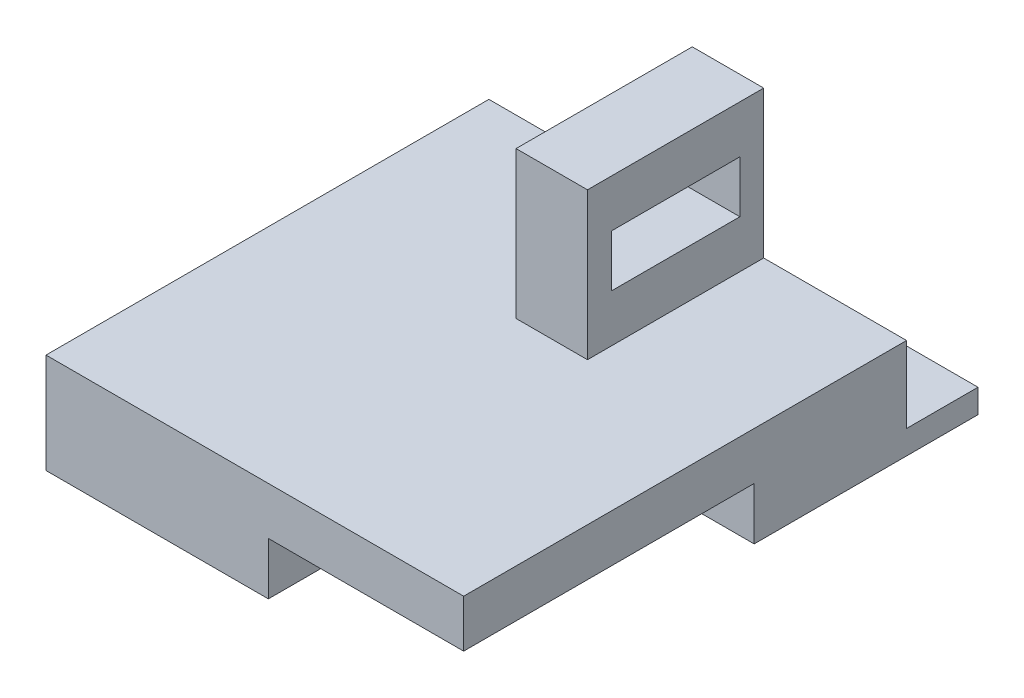
ISO-10303-21;
HEADER;
FILE_DESCRIPTION(('STEP AP214'),'2;1');
FILE_NAME('part.step','',(''),(''),'','','');
FILE_SCHEMA(('AUTOMOTIVE_DESIGN { 1 0 10303 214 1 1 1 1 }'));
ENDSEC;
DATA;
#1=APPLICATION_CONTEXT('core data for automotive mechanical design processes');
#2=APPLICATION_PROTOCOL_DEFINITION('international standard','automotive_design',2000,#1);
#3=PRODUCT_CONTEXT('',#1,'mechanical');
#4=PRODUCT('Part','Part','',(#3));
#5=PRODUCT_RELATED_PRODUCT_CATEGORY('part','',(#4));
#6=PRODUCT_DEFINITION_FORMATION('','',#4);
#7=PRODUCT_DEFINITION_CONTEXT('part definition',#1,'design');
#8=PRODUCT_DEFINITION('design','',#6,#7);
#9=PRODUCT_DEFINITION_SHAPE('','',#8);
#10=(LENGTH_UNIT() NAMED_UNIT(*) SI_UNIT(.MILLI.,.METRE.));
#11=(NAMED_UNIT(*) PLANE_ANGLE_UNIT() SI_UNIT($,.RADIAN.));
#12=(NAMED_UNIT(*) SI_UNIT($,.STERADIAN.) SOLID_ANGLE_UNIT());
#13=UNCERTAINTY_MEASURE_WITH_UNIT(LENGTH_MEASURE(1.E-05),#10,'distance_accuracy_value','');
#14=(GEOMETRIC_REPRESENTATION_CONTEXT(3) GLOBAL_UNCERTAINTY_ASSIGNED_CONTEXT((#13)) GLOBAL_UNIT_ASSIGNED_CONTEXT((#10,
#11,#12)) REPRESENTATION_CONTEXT('',''));
#15=CARTESIAN_POINT('',(0.,0.,0.));
#16=DIRECTION('',(0.,0.,1.));
#17=DIRECTION('',(1.,0.,0.));
#18=AXIS2_PLACEMENT_3D('',#15,#16,#17);
#19=CARTESIAN_POINT('',(0.,21.,0.));
#20=DIRECTION('',(0.,-1.,0.));
#21=DIRECTION('',(0.,0.,-1.));
#22=AXIS2_PLACEMENT_3D('',#19,#20,#21);
#23=PLANE('',#22);
#24=DIRECTION('',(0.,0.,-1.));
#25=VECTOR('',#24,1.);
#26=CARTESIAN_POINT('',(57.7,21.,-93.));
#27=LINE('',#26,#25);
#28=CARTESIAN_POINT('',(57.7,21.,-56.));
#29=VERTEX_POINT('',#28);
#30=CARTESIAN_POINT('',(57.7,21.,-93.));
#31=VERTEX_POINT('',#30);
#32=EDGE_CURVE('E180',#29,#31,#27,.T.);
#33=ORIENTED_EDGE('',*,*,#32,.F.);
#34=DIRECTION('',(1.,0.,0.));
#35=VECTOR('',#34,1.);
#36=CARTESIAN_POINT('',(57.7,21.,-56.));
#37=LINE('',#36,#35);
#38=CARTESIAN_POINT('',(42.7,21.,-56.));
#39=VERTEX_POINT('',#38);
#40=EDGE_CURVE('E187',#39,#29,#37,.T.);
#41=ORIENTED_EDGE('',*,*,#40,.F.);
#42=DIRECTION('',(0.,0.,1.));
#43=VECTOR('',#42,1.);
#44=CARTESIAN_POINT('',(42.7,21.,-93.));
#45=LINE('',#44,#43);
#46=CARTESIAN_POINT('',(42.7,21.,-93.));
#47=VERTEX_POINT('',#46);
#48=EDGE_CURVE('E196',#47,#39,#45,.T.);
#49=ORIENTED_EDGE('',*,*,#48,.F.);
#50=DIRECTION('',(1.,0.,0.));
#51=VECTOR('',#50,1.);
#52=CARTESIAN_POINT('',(0.,21.,-93.));
#53=LINE('',#52,#51);
#54=CARTESIAN_POINT('',(0.,21.,-93.));
#55=VERTEX_POINT('',#54);
#56=EDGE_CURVE('E217',#55,#47,#53,.T.);
#57=ORIENTED_EDGE('',*,*,#56,.F.);
#58=DIRECTION('',(0.,0.,1.));
#59=VECTOR('',#58,1.);
#60=CARTESIAN_POINT('',(0.,21.,0.));
#61=LINE('',#60,#59);
#62=CARTESIAN_POINT('',(0.,21.,0.));
#63=VERTEX_POINT('',#62);
#64=EDGE_CURVE('E255',#55,#63,#61,.T.);
#65=ORIENTED_EDGE('',*,*,#64,.T.);
#66=DIRECTION('',(1.,0.,0.));
#67=VECTOR('',#66,1.);
#68=CARTESIAN_POINT('',(0.,21.,0.));
#69=LINE('',#68,#67);
#70=CARTESIAN_POINT('',(87.7,21.,0.));
#71=VERTEX_POINT('',#70);
#72=EDGE_CURVE('E257',#63,#71,#69,.T.);
#73=ORIENTED_EDGE('',*,*,#72,.T.);
#74=DIRECTION('',(0.,0.,-1.));
#75=VECTOR('',#74,1.);
#76=CARTESIAN_POINT('',(87.7,21.,0.));
#77=LINE('',#76,#75);
#78=CARTESIAN_POINT('',(87.7,21.,-93.));
#79=VERTEX_POINT('',#78);
#80=EDGE_CURVE('E260',#71,#79,#77,.T.);
#81=ORIENTED_EDGE('',*,*,#80,.T.);
#82=EDGE_CURVE('E212',#31,#79,#53,.T.);
#83=ORIENTED_EDGE('',*,*,#82,.F.);
#84=EDGE_LOOP('',(#33,#41,#49,#57,#65,#73,#81,#83));
#85=FACE_BOUND('',#84,.T.);
#86=ADVANCED_FACE('F35',(#85),#23,.F.);
#87=CARTESIAN_POINT('',(0.,21.,-108.));
#88=DIRECTION('',(0.,0.,1.));
#89=DIRECTION('',(1.,0.,0.));
#90=AXIS2_PLACEMENT_3D('',#87,#88,#89);
#91=PLANE('',#90);
#92=DIRECTION('',(-1.,0.,0.));
#93=VECTOR('',#92,1.);
#94=CARTESIAN_POINT('',(0.,5.,-108.));
#95=LINE('',#94,#93);
#96=CARTESIAN_POINT('',(87.7,5.,-108.));
#97=VERTEX_POINT('',#96);
#98=CARTESIAN_POINT('',(0.,5.,-108.));
#99=VERTEX_POINT('',#98);
#100=EDGE_CURVE('E222',#97,#99,#95,.T.);
#101=ORIENTED_EDGE('',*,*,#100,.F.);
#102=DIRECTION('',(0.,-1.,0.));
#103=VECTOR('',#102,1.);
#104=CARTESIAN_POINT('',(87.7,21.,-108.));
#105=LINE('',#104,#103);
#106=CARTESIAN_POINT('',(87.7,0.,-108.));
#107=VERTEX_POINT('',#106);
#108=EDGE_CURVE('E275',#97,#107,#105,.T.);
#109=ORIENTED_EDGE('',*,*,#108,.T.);
#110=DIRECTION('',(-1.,0.,0.));
#111=VECTOR('',#110,1.);
#112=CARTESIAN_POINT('',(0.,0.,-108.));
#113=LINE('',#112,#111);
#114=CARTESIAN_POINT('',(0.,0.,-108.));
#115=VERTEX_POINT('',#114);
#116=EDGE_CURVE('E258',#107,#115,#113,.T.);
#117=ORIENTED_EDGE('',*,*,#116,.T.);
#118=DIRECTION('',(0.,-1.,0.));
#119=VECTOR('',#118,1.);
#120=CARTESIAN_POINT('',(0.,21.,-108.));
#121=LINE('',#120,#119);
#122=EDGE_CURVE('E263',#99,#115,#121,.T.);
#123=ORIENTED_EDGE('',*,*,#122,.F.);
#124=EDGE_LOOP('',(#101,#109,#117,#123));
#125=FACE_BOUND('',#124,.T.);
#126=ADVANCED_FACE('F306',(#125),#91,.F.);
#127=CARTESIAN_POINT('',(0.,21.,0.));
#128=DIRECTION('',(1.,0.,0.));
#129=DIRECTION('',(0.,0.,-1.));
#130=AXIS2_PLACEMENT_3D('',#127,#128,#129);
#131=PLANE('',#130);
#132=ORIENTED_EDGE('',*,*,#64,.F.);
#133=DIRECTION('',(0.,1.,0.));
#134=VECTOR('',#133,1.);
#135=CARTESIAN_POINT('',(0.,5.,-93.));
#136=LINE('',#135,#134);
#137=CARTESIAN_POINT('',(0.,5.,-93.));
#138=VERTEX_POINT('',#137);
#139=EDGE_CURVE('E224',#138,#55,#136,.T.);
#140=ORIENTED_EDGE('',*,*,#139,.F.);
#141=DIRECTION('',(0.,0.,1.));
#142=VECTOR('',#141,1.);
#143=CARTESIAN_POINT('',(0.,5.,-108.));
#144=LINE('',#143,#142);
#145=EDGE_CURVE('E213',#99,#138,#144,.T.);
#146=ORIENTED_EDGE('',*,*,#145,.F.);
#147=ORIENTED_EDGE('',*,*,#122,.T.);
#148=DIRECTION('',(0.,0.,1.));
#149=VECTOR('',#148,1.);
#150=CARTESIAN_POINT('',(0.,0.,0.));
#151=LINE('',#150,#149);
#152=CARTESIAN_POINT('',(0.,0.,0.));
#153=VERTEX_POINT('',#152);
#154=EDGE_CURVE('E251',#115,#153,#151,.T.);
#155=ORIENTED_EDGE('',*,*,#154,.T.);
#156=DIRECTION('',(0.,-1.,0.));
#157=VECTOR('',#156,1.);
#158=CARTESIAN_POINT('',(0.,21.,0.));
#159=LINE('',#158,#157);
#160=EDGE_CURVE('E280',#63,#153,#159,.T.);
#161=ORIENTED_EDGE('',*,*,#160,.F.);
#162=EDGE_LOOP('',(#132,#140,#146,#147,#155,#161));
#163=FACE_BOUND('',#162,.T.);
#164=ADVANCED_FACE('F37',(#163),#131,.F.);
#165=CARTESIAN_POINT('',(0.,21.,0.));
#166=DIRECTION('',(0.,0.,-1.));
#167=DIRECTION('',(-1.,0.,0.));
#168=AXIS2_PLACEMENT_3D('',#165,#166,#167);
#169=PLANE('',#168);
#170=DIRECTION('',(1.,0.,0.));
#171=VECTOR('',#170,1.);
#172=CARTESIAN_POINT('',(0.,0.,0.));
#173=LINE('',#172,#171);
#174=CARTESIAN_POINT('',(46.6919549273825,0.,0.));
#175=VERTEX_POINT('',#174);
#176=EDGE_CURVE('E266',#153,#175,#173,.T.);
#177=ORIENTED_EDGE('',*,*,#176,.T.);
#178=DIRECTION('',(0.,-1.,0.));
#179=VECTOR('',#178,1.);
#180=CARTESIAN_POINT('',(46.6919549273825,11.,0.));
#181=LINE('',#180,#179);
#182=CARTESIAN_POINT('',(46.6919549273825,11.,0.));
#183=VERTEX_POINT('',#182);
#184=EDGE_CURVE('E244',#183,#175,#181,.T.);
#185=ORIENTED_EDGE('',*,*,#184,.F.);
#186=DIRECTION('',(-1.,0.,0.));
#187=VECTOR('',#186,1.);
#188=CARTESIAN_POINT('',(87.7,11.,0.));
#189=LINE('',#188,#187);
#190=CARTESIAN_POINT('',(87.7,11.,0.));
#191=VERTEX_POINT('',#190);
#192=EDGE_CURVE('E234',#191,#183,#189,.T.);
#193=ORIENTED_EDGE('',*,*,#192,.F.);
#194=DIRECTION('',(0.,-1.,0.));
#195=VECTOR('',#194,1.);
#196=CARTESIAN_POINT('',(87.7,21.,0.));
#197=LINE('',#196,#195);
#198=EDGE_CURVE('E277',#71,#191,#197,.T.);
#199=ORIENTED_EDGE('',*,*,#198,.F.);
#200=ORIENTED_EDGE('',*,*,#72,.F.);
#201=ORIENTED_EDGE('',*,*,#160,.T.);
#202=EDGE_LOOP('',(#177,#185,#193,#199,#200,#201));
#203=FACE_BOUND('',#202,.T.);
#204=ADVANCED_FACE('F327',(#203),#169,.F.);
#205=CARTESIAN_POINT('',(87.7,21.,0.));
#206=DIRECTION('',(-1.,0.,0.));
#207=DIRECTION('',(0.,0.,1.));
#208=AXIS2_PLACEMENT_3D('',#205,#206,#207);
#209=PLANE('',#208);
#210=DIRECTION('',(0.,0.,-1.));
#211=VECTOR('',#210,1.);
#212=CARTESIAN_POINT('',(87.7,5.,-108.));
#213=LINE('',#212,#211);
#214=CARTESIAN_POINT('',(87.7,5.,-93.));
#215=VERTEX_POINT('',#214);
#216=EDGE_CURVE('E220',#215,#97,#213,.T.);
#217=ORIENTED_EDGE('',*,*,#216,.F.);
#218=DIRECTION('',(0.,1.,0.));
#219=VECTOR('',#218,1.);
#220=CARTESIAN_POINT('',(87.7,5.,-93.));
#221=LINE('',#220,#219);
#222=EDGE_CURVE('E227',#215,#79,#221,.T.);
#223=ORIENTED_EDGE('',*,*,#222,.T.);
#224=ORIENTED_EDGE('',*,*,#80,.F.);
#225=ORIENTED_EDGE('',*,*,#198,.T.);
#226=DIRECTION('',(0.,0.,1.));
#227=VECTOR('',#226,1.);
#228=CARTESIAN_POINT('',(87.7,11.,0.));
#229=LINE('',#228,#227);
#230=CARTESIAN_POINT('',(87.7,11.,-61.));
#231=VERTEX_POINT('',#230);
#232=EDGE_CURVE('E232',#231,#191,#229,.T.);
#233=ORIENTED_EDGE('',*,*,#232,.F.);
#234=DIRECTION('',(0.,-1.,0.));
#235=VECTOR('',#234,1.);
#236=CARTESIAN_POINT('',(87.7,11.,-61.));
#237=LINE('',#236,#235);
#238=CARTESIAN_POINT('',(87.7,0.,-61.));
#239=VERTEX_POINT('',#238);
#240=EDGE_CURVE('E248',#231,#239,#237,.T.);
#241=ORIENTED_EDGE('',*,*,#240,.T.);
#242=DIRECTION('',(0.,0.,-1.));
#243=VECTOR('',#242,1.);
#244=CARTESIAN_POINT('',(87.7,0.,0.));
#245=LINE('',#244,#243);
#246=EDGE_CURVE('E269',#239,#107,#245,.T.);
#247=ORIENTED_EDGE('',*,*,#246,.T.);
#248=ORIENTED_EDGE('',*,*,#108,.F.);
#249=EDGE_LOOP('',(#217,#223,#224,#225,#233,#241,#247,#248));
#250=FACE_BOUND('',#249,.T.);
#251=ADVANCED_FACE('F323',(#250),#209,.F.);
#252=CARTESIAN_POINT('',(0.,0.,0.));
#253=DIRECTION('',(0.,-1.,0.));
#254=DIRECTION('',(0.,0.,-1.));
#255=AXIS2_PLACEMENT_3D('',#252,#253,#254);
#256=PLANE('',#255);
#257=DIRECTION('',(1.,0.,0.));
#258=VECTOR('',#257,1.);
#259=CARTESIAN_POINT('',(87.7,0.,-61.));
#260=LINE('',#259,#258);
#261=CARTESIAN_POINT('',(46.6919549273825,0.,-61.));
#262=VERTEX_POINT('',#261);
#263=EDGE_CURVE('E235',#262,#239,#260,.T.);
#264=ORIENTED_EDGE('',*,*,#263,.F.);
#265=DIRECTION('',(0.,0.,-1.));
#266=VECTOR('',#265,1.);
#267=CARTESIAN_POINT('',(46.6919549273825,0.,0.));
#268=LINE('',#267,#266);
#269=EDGE_CURVE('E230',#175,#262,#268,.T.);
#270=ORIENTED_EDGE('',*,*,#269,.F.);
#271=ORIENTED_EDGE('',*,*,#176,.F.);
#272=ORIENTED_EDGE('',*,*,#154,.F.);
#273=ORIENTED_EDGE('',*,*,#116,.F.);
#274=ORIENTED_EDGE('',*,*,#246,.F.);
#275=EDGE_LOOP('',(#264,#270,#271,#272,#273,#274));
#276=FACE_BOUND('',#275,.T.);
#277=ADVANCED_FACE('F320',(#276),#256,.T.);
#278=CARTESIAN_POINT('',(87.7,11.,-61.));
#279=DIRECTION('',(0.,0.,-1.));
#280=DIRECTION('',(-1.,0.,0.));
#281=AXIS2_PLACEMENT_3D('',#278,#279,#280);
#282=PLANE('',#281);
#283=ORIENTED_EDGE('',*,*,#263,.T.);
#284=ORIENTED_EDGE('',*,*,#240,.F.);
#285=DIRECTION('',(1.,0.,0.));
#286=VECTOR('',#285,1.);
#287=CARTESIAN_POINT('',(87.7,11.,-61.));
#288=LINE('',#287,#286);
#289=CARTESIAN_POINT('',(46.6919549273825,11.,-61.));
#290=VERTEX_POINT('',#289);
#291=EDGE_CURVE('E241',#290,#231,#288,.T.);
#292=ORIENTED_EDGE('',*,*,#291,.F.);
#293=DIRECTION('',(0.,-1.,0.));
#294=VECTOR('',#293,1.);
#295=CARTESIAN_POINT('',(46.6919549273825,11.,-61.));
#296=LINE('',#295,#294);
#297=EDGE_CURVE('E252',#290,#262,#296,.T.);
#298=ORIENTED_EDGE('',*,*,#297,.T.);
#299=EDGE_LOOP('',(#283,#284,#292,#298));
#300=FACE_BOUND('',#299,.T.);
#301=ADVANCED_FACE('F322',(#300),#282,.F.);
#302=CARTESIAN_POINT('',(46.6919549273825,11.,0.));
#303=DIRECTION('',(-1.,0.,0.));
#304=DIRECTION('',(0.,0.,1.));
#305=AXIS2_PLACEMENT_3D('',#302,#303,#304);
#306=PLANE('',#305);
#307=ORIENTED_EDGE('',*,*,#269,.T.);
#308=ORIENTED_EDGE('',*,*,#297,.F.);
#309=DIRECTION('',(0.,0.,-1.));
#310=VECTOR('',#309,1.);
#311=CARTESIAN_POINT('',(46.6919549273825,11.,0.));
#312=LINE('',#311,#310);
#313=EDGE_CURVE('E238',#183,#290,#312,.T.);
#314=ORIENTED_EDGE('',*,*,#313,.F.);
#315=ORIENTED_EDGE('',*,*,#184,.T.);
#316=EDGE_LOOP('',(#307,#308,#314,#315));
#317=FACE_BOUND('',#316,.T.);
#318=ADVANCED_FACE('F318',(#317),#306,.F.);
#319=CARTESIAN_POINT('',(0.,11.,0.));
#320=DIRECTION('',(0.,1.,0.));
#321=DIRECTION('',(0.,0.,1.));
#322=AXIS2_PLACEMENT_3D('',#319,#320,#321);
#323=PLANE('',#322);
#324=ORIENTED_EDGE('',*,*,#232,.T.);
#325=ORIENTED_EDGE('',*,*,#192,.T.);
#326=ORIENTED_EDGE('',*,*,#313,.T.);
#327=ORIENTED_EDGE('',*,*,#291,.T.);
#328=EDGE_LOOP('',(#324,#325,#326,#327));
#329=FACE_BOUND('',#328,.T.);
#330=ADVANCED_FACE('F347',(#329),#323,.F.);
#331=CARTESIAN_POINT('',(0.,5.,-93.));
#332=DIRECTION('',(0.,0.,1.));
#333=DIRECTION('',(1.,0.,0.));
#334=AXIS2_PLACEMENT_3D('',#331,#332,#333);
#335=PLANE('',#334);
#336=ORIENTED_EDGE('',*,*,#56,.T.);
#337=DIRECTION('',(0.,-1.,0.));
#338=VECTOR('',#337,1.);
#339=CARTESIAN_POINT('',(42.7,51.9,-93.));
#340=LINE('',#339,#338);
#341=CARTESIAN_POINT('',(42.7,51.9,-93.));
#342=VERTEX_POINT('',#341);
#343=EDGE_CURVE('E206',#342,#47,#340,.T.);
#344=ORIENTED_EDGE('',*,*,#343,.F.);
#345=DIRECTION('',(-1.,0.,0.));
#346=VECTOR('',#345,1.);
#347=CARTESIAN_POINT('',(57.7,51.9,-93.));
#348=LINE('',#347,#346);
#349=CARTESIAN_POINT('',(57.7,51.9,-93.));
#350=VERTEX_POINT('',#349);
#351=EDGE_CURVE('E186',#350,#342,#348,.T.);
#352=ORIENTED_EDGE('',*,*,#351,.F.);
#353=DIRECTION('',(0.,-1.,0.));
#354=VECTOR('',#353,1.);
#355=CARTESIAN_POINT('',(57.7,51.9,-93.));
#356=LINE('',#355,#354);
#357=EDGE_CURVE('E209',#350,#31,#356,.T.);
#358=ORIENTED_EDGE('',*,*,#357,.T.);
#359=ORIENTED_EDGE('',*,*,#82,.T.);
#360=ORIENTED_EDGE('',*,*,#222,.F.);
#361=DIRECTION('',(1.,0.,0.));
#362=VECTOR('',#361,1.);
#363=CARTESIAN_POINT('',(0.,5.,-93.));
#364=LINE('',#363,#362);
#365=EDGE_CURVE('E216',#138,#215,#364,.T.);
#366=ORIENTED_EDGE('',*,*,#365,.F.);
#367=ORIENTED_EDGE('',*,*,#139,.T.);
#368=EDGE_LOOP('',(#336,#344,#352,#358,#359,#360,#366,#367));
#369=FACE_BOUND('',#368,.T.);
#370=ADVANCED_FACE('F367',(#369),#335,.F.);
#371=CARTESIAN_POINT('',(0.,5.,0.));
#372=DIRECTION('',(0.,1.,0.));
#373=DIRECTION('',(0.,0.,1.));
#374=AXIS2_PLACEMENT_3D('',#371,#372,#373);
#375=PLANE('',#374);
#376=ORIENTED_EDGE('',*,*,#145,.T.);
#377=ORIENTED_EDGE('',*,*,#365,.T.);
#378=ORIENTED_EDGE('',*,*,#216,.T.);
#379=ORIENTED_EDGE('',*,*,#100,.T.);
#380=EDGE_LOOP('',(#376,#377,#378,#379));
#381=FACE_BOUND('',#380,.T.);
#382=ADVANCED_FACE('F370',(#381),#375,.T.);
#383=CARTESIAN_POINT('',(57.7,51.9,-93.));
#384=DIRECTION('',(-1.,0.,0.));
#385=DIRECTION('',(0.,0.,1.));
#386=AXIS2_PLACEMENT_3D('',#383,#384,#385);
#387=PLANE('',#386);
#388=DIRECTION('',(0.,0.,1.));
#389=VECTOR('',#388,1.);
#390=CARTESIAN_POINT('',(57.7,41.9,-88.));
#391=LINE('',#390,#389);
#392=CARTESIAN_POINT('',(57.7,41.9,-88.));
#393=VERTEX_POINT('',#392);
#394=CARTESIAN_POINT('',(57.7,41.9,-61.));
#395=VERTEX_POINT('',#394);
#396=EDGE_CURVE('E166',#393,#395,#391,.T.);
#397=ORIENTED_EDGE('',*,*,#396,.F.);
#398=DIRECTION('',(0.,1.,0.));
#399=VECTOR('',#398,1.);
#400=CARTESIAN_POINT('',(57.7,31.,-88.));
#401=LINE('',#400,#399);
#402=CARTESIAN_POINT('',(57.7,31.,-88.));
#403=VERTEX_POINT('',#402);
#404=EDGE_CURVE('E50',#403,#393,#401,.T.);
#405=ORIENTED_EDGE('',*,*,#404,.F.);
#406=DIRECTION('',(0.,0.,-1.));
#407=VECTOR('',#406,1.);
#408=CARTESIAN_POINT('',(57.7,31.,-88.));
#409=LINE('',#408,#407);
#410=CARTESIAN_POINT('',(57.7,31.,-61.));
#411=VERTEX_POINT('',#410);
#412=EDGE_CURVE('E173',#411,#403,#409,.T.);
#413=ORIENTED_EDGE('',*,*,#412,.F.);
#414=DIRECTION('',(0.,-1.,0.));
#415=VECTOR('',#414,1.);
#416=CARTESIAN_POINT('',(57.7,31.,-61.));
#417=LINE('',#416,#415);
#418=EDGE_CURVE('E157',#395,#411,#417,.T.);
#419=ORIENTED_EDGE('',*,*,#418,.F.);
#420=EDGE_LOOP('',(#397,#405,#413,#419));
#421=FACE_BOUND('',#420,.T.);
#422=ORIENTED_EDGE('',*,*,#32,.T.);
#423=ORIENTED_EDGE('',*,*,#357,.F.);
#424=DIRECTION('',(0.,0.,-1.));
#425=VECTOR('',#424,1.);
#426=CARTESIAN_POINT('',(57.7,51.9,-93.));
#427=LINE('',#426,#425);
#428=CARTESIAN_POINT('',(57.7,51.9,-56.));
#429=VERTEX_POINT('',#428);
#430=EDGE_CURVE('E183',#429,#350,#427,.T.);
#431=ORIENTED_EDGE('',*,*,#430,.F.);
#432=DIRECTION('',(0.,-1.,0.));
#433=VECTOR('',#432,1.);
#434=CARTESIAN_POINT('',(57.7,51.9,-56.));
#435=LINE('',#434,#433);
#436=EDGE_CURVE('E193',#429,#29,#435,.T.);
#437=ORIENTED_EDGE('',*,*,#436,.T.);
#438=EDGE_LOOP('',(#422,#423,#431,#437));
#439=FACE_BOUND('',#438,.T.);
#440=ADVANCED_FACE('F170',(#421,#439),#387,.F.);
#441=CARTESIAN_POINT('',(42.7,51.9,-93.));
#442=DIRECTION('',(1.,0.,0.));
#443=DIRECTION('',(0.,0.,-1.));
#444=AXIS2_PLACEMENT_3D('',#441,#442,#443);
#445=PLANE('',#444);
#446=DIRECTION('',(0.,0.,-1.));
#447=VECTOR('',#446,1.);
#448=CARTESIAN_POINT('',(42.7,31.,-93.));
#449=LINE('',#448,#447);
#450=CARTESIAN_POINT('',(42.7,31.,-61.));
#451=VERTEX_POINT('',#450);
#452=CARTESIAN_POINT('',(42.7,31.,-88.));
#453=VERTEX_POINT('',#452);
#454=EDGE_CURVE('E43',#451,#453,#449,.T.);
#455=ORIENTED_EDGE('',*,*,#454,.T.);
#456=DIRECTION('',(0.,1.,0.));
#457=VECTOR('',#456,1.);
#458=CARTESIAN_POINT('',(42.7,51.9,-88.));
#459=LINE('',#458,#457);
#460=CARTESIAN_POINT('',(42.7,41.9,-88.));
#461=VERTEX_POINT('',#460);
#462=EDGE_CURVE('E11',#453,#461,#459,.T.);
#463=ORIENTED_EDGE('',*,*,#462,.T.);
#464=DIRECTION('',(0.,0.,1.));
#465=VECTOR('',#464,1.);
#466=CARTESIAN_POINT('',(42.7,41.9,-93.));
#467=LINE('',#466,#465);
#468=CARTESIAN_POINT('',(42.7,41.9,-61.));
#469=VERTEX_POINT('',#468);
#470=EDGE_CURVE('E283',#461,#469,#467,.T.);
#471=ORIENTED_EDGE('',*,*,#470,.T.);
#472=DIRECTION('',(0.,-1.,0.));
#473=VECTOR('',#472,1.);
#474=CARTESIAN_POINT('',(42.7,51.9,-61.));
#475=LINE('',#474,#473);
#476=EDGE_CURVE('E160',#469,#451,#475,.T.);
#477=ORIENTED_EDGE('',*,*,#476,.T.);
#478=EDGE_LOOP('',(#455,#463,#471,#477));
#479=FACE_BOUND('',#478,.T.);
#480=ORIENTED_EDGE('',*,*,#48,.T.);
#481=DIRECTION('',(0.,-1.,0.));
#482=VECTOR('',#481,1.);
#483=CARTESIAN_POINT('',(42.7,51.9,-56.));
#484=LINE('',#483,#482);
#485=CARTESIAN_POINT('',(42.7,51.9,-56.));
#486=VERTEX_POINT('',#485);
#487=EDGE_CURVE('E203',#486,#39,#484,.T.);
#488=ORIENTED_EDGE('',*,*,#487,.F.);
#489=DIRECTION('',(0.,0.,1.));
#490=VECTOR('',#489,1.);
#491=CARTESIAN_POINT('',(42.7,51.9,-93.));
#492=LINE('',#491,#490);
#493=EDGE_CURVE('E189',#342,#486,#492,.T.);
#494=ORIENTED_EDGE('',*,*,#493,.F.);
#495=ORIENTED_EDGE('',*,*,#343,.T.);
#496=EDGE_LOOP('',(#480,#488,#494,#495));
#497=FACE_BOUND('',#496,.T.);
#498=ADVANCED_FACE('F287',(#479,#497),#445,.F.);
#499=CARTESIAN_POINT('',(57.7,51.9,-56.));
#500=DIRECTION('',(0.,0.,-1.));
#501=DIRECTION('',(-1.,0.,0.));
#502=AXIS2_PLACEMENT_3D('',#499,#500,#501);
#503=PLANE('',#502);
#504=ORIENTED_EDGE('',*,*,#40,.T.);
#505=ORIENTED_EDGE('',*,*,#436,.F.);
#506=DIRECTION('',(1.,0.,0.));
#507=VECTOR('',#506,1.);
#508=CARTESIAN_POINT('',(57.7,51.9,-56.));
#509=LINE('',#508,#507);
#510=EDGE_CURVE('E191',#486,#429,#509,.T.);
#511=ORIENTED_EDGE('',*,*,#510,.F.);
#512=ORIENTED_EDGE('',*,*,#487,.T.);
#513=EDGE_LOOP('',(#504,#505,#511,#512));
#514=FACE_BOUND('',#513,.T.);
#515=ADVANCED_FACE('F301',(#514),#503,.F.);
#516=CARTESIAN_POINT('',(0.,51.9,0.));
#517=DIRECTION('',(0.,-1.,0.));
#518=DIRECTION('',(0.,0.,-1.));
#519=AXIS2_PLACEMENT_3D('',#516,#517,#518);
#520=PLANE('',#519);
#521=ORIENTED_EDGE('',*,*,#430,.T.);
#522=ORIENTED_EDGE('',*,*,#351,.T.);
#523=ORIENTED_EDGE('',*,*,#493,.T.);
#524=ORIENTED_EDGE('',*,*,#510,.T.);
#525=EDGE_LOOP('',(#521,#522,#523,#524));
#526=FACE_BOUND('',#525,.T.);
#527=ADVANCED_FACE('F294',(#526),#520,.F.);
#528=CARTESIAN_POINT('',(26.8,31.,-88.));
#529=DIRECTION('',(0.,0.,-1.));
#530=DIRECTION('',(-1.,0.,0.));
#531=AXIS2_PLACEMENT_3D('',#528,#529,#530);
#532=PLANE('',#531);
#533=DIRECTION('',(1.,0.,0.));
#534=VECTOR('',#533,1.);
#535=CARTESIAN_POINT('',(26.8,31.,-88.));
#536=LINE('',#535,#534);
#537=EDGE_CURVE('E178',#453,#403,#536,.T.);
#538=ORIENTED_EDGE('',*,*,#537,.T.);
#539=ORIENTED_EDGE('',*,*,#404,.T.);
#540=DIRECTION('',(1.,0.,0.));
#541=VECTOR('',#540,1.);
#542=CARTESIAN_POINT('',(26.8,41.9,-88.));
#543=LINE('',#542,#541);
#544=EDGE_CURVE('E163',#461,#393,#543,.T.);
#545=ORIENTED_EDGE('',*,*,#544,.F.);
#546=ORIENTED_EDGE('',*,*,#462,.F.);
#547=EDGE_LOOP('',(#538,#539,#545,#546));
#548=FACE_BOUND('',#547,.T.);
#549=ADVANCED_FACE('F292',(#548),#532,.F.);
#550=CARTESIAN_POINT('',(26.8,31.,-88.));
#551=DIRECTION('',(0.,-1.,0.));
#552=DIRECTION('',(0.,0.,-1.));
#553=AXIS2_PLACEMENT_3D('',#550,#551,#552);
#554=PLANE('',#553);
#555=DIRECTION('',(1.,0.,0.));
#556=VECTOR('',#555,1.);
#557=CARTESIAN_POINT('',(26.8,31.,-61.));
#558=LINE('',#557,#556);
#559=EDGE_CURVE('E162',#451,#411,#558,.T.);
#560=ORIENTED_EDGE('',*,*,#559,.T.);
#561=ORIENTED_EDGE('',*,*,#412,.T.);
#562=ORIENTED_EDGE('',*,*,#537,.F.);
#563=ORIENTED_EDGE('',*,*,#454,.F.);
#564=EDGE_LOOP('',(#560,#561,#562,#563));
#565=FACE_BOUND('',#564,.T.);
#566=ADVANCED_FACE('F291',(#565),#554,.F.);
#567=CARTESIAN_POINT('',(26.8,31.,-61.));
#568=DIRECTION('',(0.,0.,1.));
#569=DIRECTION('',(1.,0.,0.));
#570=AXIS2_PLACEMENT_3D('',#567,#568,#569);
#571=PLANE('',#570);
#572=DIRECTION('',(1.,0.,0.));
#573=VECTOR('',#572,1.);
#574=CARTESIAN_POINT('',(26.8,41.9,-61.));
#575=LINE('',#574,#573);
#576=EDGE_CURVE('E58',#469,#395,#575,.T.);
#577=ORIENTED_EDGE('',*,*,#576,.T.);
#578=ORIENTED_EDGE('',*,*,#418,.T.);
#579=ORIENTED_EDGE('',*,*,#559,.F.);
#580=ORIENTED_EDGE('',*,*,#476,.F.);
#581=EDGE_LOOP('',(#577,#578,#579,#580));
#582=FACE_BOUND('',#581,.T.);
#583=ADVANCED_FACE('F154',(#582),#571,.F.);
#584=CARTESIAN_POINT('',(26.8,41.9,-88.));
#585=DIRECTION('',(0.,1.,0.));
#586=DIRECTION('',(0.,0.,1.));
#587=AXIS2_PLACEMENT_3D('',#584,#585,#586);
#588=PLANE('',#587);
#589=ORIENTED_EDGE('',*,*,#544,.T.);
#590=ORIENTED_EDGE('',*,*,#396,.T.);
#591=ORIENTED_EDGE('',*,*,#576,.F.);
#592=ORIENTED_EDGE('',*,*,#470,.F.);
#593=EDGE_LOOP('',(#589,#590,#591,#592));
#594=FACE_BOUND('',#593,.T.);
#595=ADVANCED_FACE('F167',(#594),#588,.F.);
#596=CLOSED_SHELL('',(#86,#126,#164,#204,#251,#277,#301,#318,#330,#370,#382,#440,#498,#515,#527,
#549,#566,#583,#595));
#597=MANIFOLD_SOLID_BREP('B2',#596);
#598=ADVANCED_BREP_SHAPE_REPRESENTATION('',(#18,#597),#14);
#599=SHAPE_DEFINITION_REPRESENTATION(#9,#598);
ENDSEC;
END-ISO-10303-21;
